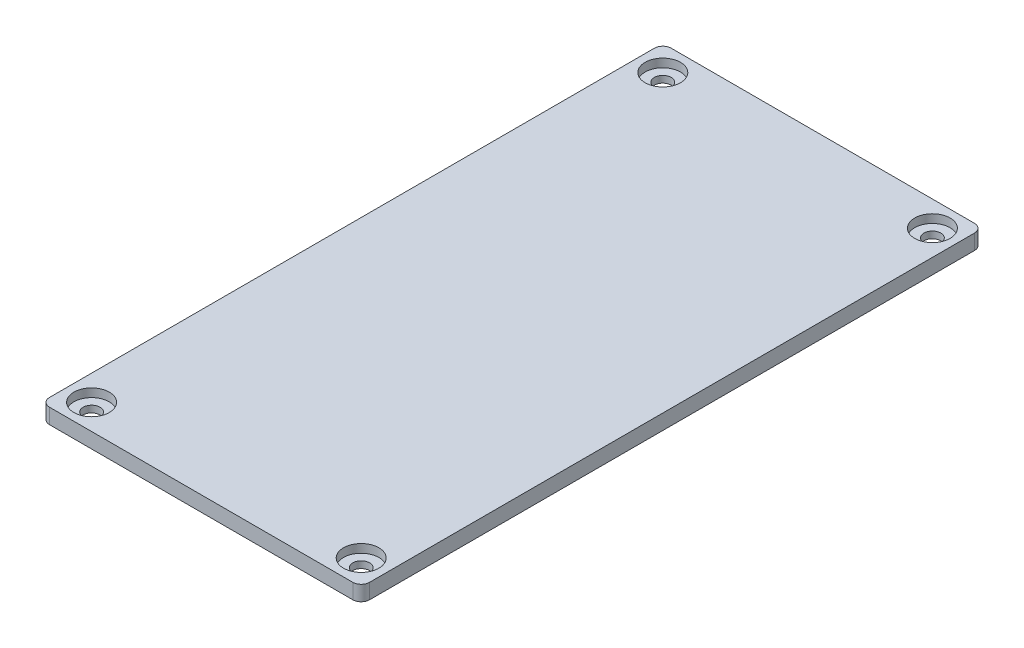
ISO-10303-21;
HEADER;
FILE_DESCRIPTION(('STEP AP214'),'2;1');
FILE_NAME('part.step','',(''),(''),'','','');
FILE_SCHEMA(('AUTOMOTIVE_DESIGN { 1 0 10303 214 1 1 1 1 }'));
ENDSEC;
DATA;
#1=APPLICATION_CONTEXT('core data for automotive mechanical design processes');
#2=APPLICATION_PROTOCOL_DEFINITION('international standard','automotive_design',2000,#1);
#3=PRODUCT_CONTEXT('',#1,'mechanical');
#4=PRODUCT('Part','Part','',(#3));
#5=PRODUCT_RELATED_PRODUCT_CATEGORY('part','',(#4));
#6=PRODUCT_DEFINITION_FORMATION('','',#4);
#7=PRODUCT_DEFINITION_CONTEXT('part definition',#1,'design');
#8=PRODUCT_DEFINITION('design','',#6,#7);
#9=PRODUCT_DEFINITION_SHAPE('','',#8);
#10=(LENGTH_UNIT() NAMED_UNIT(*) SI_UNIT(.MILLI.,.METRE.));
#11=(NAMED_UNIT(*) PLANE_ANGLE_UNIT() SI_UNIT($,.RADIAN.));
#12=(NAMED_UNIT(*) SI_UNIT($,.STERADIAN.) SOLID_ANGLE_UNIT());
#13=UNCERTAINTY_MEASURE_WITH_UNIT(LENGTH_MEASURE(1.E-05),#10,'distance_accuracy_value','');
#14=(GEOMETRIC_REPRESENTATION_CONTEXT(3) GLOBAL_UNCERTAINTY_ASSIGNED_CONTEXT((#13)) GLOBAL_UNIT_ASSIGNED_CONTEXT((#10,
#11,#12)) REPRESENTATION_CONTEXT('',''));
#15=CARTESIAN_POINT('',(0.,0.,0.));
#16=DIRECTION('',(0.,0.,1.));
#17=DIRECTION('',(1.,0.,0.));
#18=AXIS2_PLACEMENT_3D('',#15,#16,#17);
#19=CARTESIAN_POINT('',(16.,0.,33.9));
#20=DIRECTION('',(0.,1.,0.));
#21=DIRECTION('',(0.,0.,1.));
#22=AXIS2_PLACEMENT_3D('',#19,#20,#21);
#23=CYLINDRICAL_SURFACE('',#22,1.);
#24=CARTESIAN_POINT('',(16.,0.,33.9));
#25=DIRECTION('',(0.,-1.,0.));
#26=DIRECTION('',(0.,0.,-1.));
#27=AXIS2_PLACEMENT_3D('',#24,#25,#26);
#28=CIRCLE('',#27,1.);
#29=CARTESIAN_POINT('',(16.,0.,32.9));
#30=VERTEX_POINT('',#29);
#31=EDGE_CURVE('E147',#30,#30,#28,.T.);
#32=ORIENTED_EDGE('',*,*,#31,.T.);
#33=EDGE_LOOP('',(#32));
#34=FACE_BOUND('',#33,.T.);
#35=CARTESIAN_POINT('',(16.,0.8,33.9));
#36=DIRECTION('',(0.,1.,0.));
#37=DIRECTION('',(0.,0.,1.));
#38=AXIS2_PLACEMENT_3D('',#35,#36,#37);
#39=CIRCLE('',#38,1.);
#40=CARTESIAN_POINT('',(16.,0.8,34.9));
#41=VERTEX_POINT('',#40);
#42=EDGE_CURVE('E143',#41,#41,#39,.T.);
#43=ORIENTED_EDGE('',*,*,#42,.T.);
#44=EDGE_LOOP('',(#43));
#45=FACE_BOUND('',#44,.T.);
#46=ADVANCED_FACE('F33',(#34,#45),#23,.F.);
#47=CARTESIAN_POINT('',(-16.,0.,33.9));
#48=DIRECTION('',(0.,1.,0.));
#49=DIRECTION('',(0.,0.,1.));
#50=AXIS2_PLACEMENT_3D('',#47,#48,#49);
#51=CYLINDRICAL_SURFACE('',#50,1.);
#52=CARTESIAN_POINT('',(-16.,0.,33.9));
#53=DIRECTION('',(0.,-1.,0.));
#54=DIRECTION('',(0.,0.,-1.));
#55=AXIS2_PLACEMENT_3D('',#52,#53,#54);
#56=CIRCLE('',#55,1.);
#57=CARTESIAN_POINT('',(-16.,0.,32.9));
#58=VERTEX_POINT('',#57);
#59=EDGE_CURVE('E202',#58,#58,#56,.T.);
#60=ORIENTED_EDGE('',*,*,#59,.T.);
#61=EDGE_LOOP('',(#60));
#62=FACE_BOUND('',#61,.T.);
#63=CARTESIAN_POINT('',(-16.,0.8,33.9));
#64=DIRECTION('',(0.,1.,0.));
#65=DIRECTION('',(0.,0.,1.));
#66=AXIS2_PLACEMENT_3D('',#63,#64,#65);
#67=CIRCLE('',#66,1.);
#68=CARTESIAN_POINT('',(-16.,0.8,34.9));
#69=VERTEX_POINT('',#68);
#70=EDGE_CURVE('E140',#69,#69,#67,.T.);
#71=ORIENTED_EDGE('',*,*,#70,.T.);
#72=EDGE_LOOP('',(#71));
#73=FACE_BOUND('',#72,.T.);
#74=ADVANCED_FACE('F245',(#62,#73),#51,.F.);
#75=CARTESIAN_POINT('',(16.,0.,-33.9));
#76=DIRECTION('',(0.,1.,0.));
#77=DIRECTION('',(0.,0.,1.));
#78=AXIS2_PLACEMENT_3D('',#75,#76,#77);
#79=CYLINDRICAL_SURFACE('',#78,1.);
#80=CARTESIAN_POINT('',(16.,0.,-33.9));
#81=DIRECTION('',(0.,1.,0.));
#82=DIRECTION('',(0.,0.,1.));
#83=AXIS2_PLACEMENT_3D('',#80,#81,#82);
#84=CIRCLE('',#83,1.);
#85=CARTESIAN_POINT('',(16.,0.,-32.9));
#86=VERTEX_POINT('',#85);
#87=EDGE_CURVE('E139',#86,#86,#84,.T.);
#88=ORIENTED_EDGE('',*,*,#87,.F.);
#89=EDGE_LOOP('',(#88));
#90=FACE_BOUND('',#89,.T.);
#91=CARTESIAN_POINT('',(16.,0.8,-33.9));
#92=DIRECTION('',(0.,1.,0.));
#93=DIRECTION('',(0.,0.,1.));
#94=AXIS2_PLACEMENT_3D('',#91,#92,#93);
#95=CIRCLE('',#94,1.);
#96=CARTESIAN_POINT('',(16.,0.8,-32.9));
#97=VERTEX_POINT('',#96);
#98=EDGE_CURVE('E135',#97,#97,#95,.F.);
#99=ORIENTED_EDGE('',*,*,#98,.F.);
#100=EDGE_LOOP('',(#99));
#101=FACE_BOUND('',#100,.T.);
#102=ADVANCED_FACE('F251',(#90,#101),#79,.F.);
#103=CARTESIAN_POINT('',(-16.,0.,-33.9));
#104=DIRECTION('',(0.,1.,0.));
#105=DIRECTION('',(0.,0.,1.));
#106=AXIS2_PLACEMENT_3D('',#103,#104,#105);
#107=CYLINDRICAL_SURFACE('',#106,1.);
#108=CARTESIAN_POINT('',(-16.,0.,-33.9));
#109=DIRECTION('',(0.,1.,0.));
#110=DIRECTION('',(0.,0.,1.));
#111=AXIS2_PLACEMENT_3D('',#108,#109,#110);
#112=CIRCLE('',#111,1.);
#113=CARTESIAN_POINT('',(-16.,0.,-32.9));
#114=VERTEX_POINT('',#113);
#115=EDGE_CURVE('E192',#114,#114,#112,.T.);
#116=ORIENTED_EDGE('',*,*,#115,.F.);
#117=EDGE_LOOP('',(#116));
#118=FACE_BOUND('',#117,.T.);
#119=CARTESIAN_POINT('',(-16.,0.8,-33.9));
#120=DIRECTION('',(0.,1.,0.));
#121=DIRECTION('',(0.,0.,1.));
#122=AXIS2_PLACEMENT_3D('',#119,#120,#121);
#123=CIRCLE('',#122,1.);
#124=CARTESIAN_POINT('',(-16.,0.8,-32.9));
#125=VERTEX_POINT('',#124);
#126=EDGE_CURVE('E132',#125,#125,#123,.F.);
#127=ORIENTED_EDGE('',*,*,#126,.F.);
#128=EDGE_LOOP('',(#127));
#129=FACE_BOUND('',#128,.T.);
#130=ADVANCED_FACE('F271',(#118,#129),#107,.F.);
#131=CARTESIAN_POINT('',(19.,1.8,36.9));
#132=DIRECTION('',(-1.,0.,0.));
#133=DIRECTION('',(0.,0.,1.));
#134=AXIS2_PLACEMENT_3D('',#131,#132,#133);
#135=PLANE('',#134);
#136=DIRECTION('',(0.,0.,-1.));
#137=VECTOR('',#136,1.);
#138=CARTESIAN_POINT('',(19.,0.,36.9));
#139=LINE('',#138,#137);
#140=CARTESIAN_POINT('',(19.,0.,35.9));
#141=VERTEX_POINT('',#140);
#142=CARTESIAN_POINT('',(19.,0.,-35.9));
#143=VERTEX_POINT('',#142);
#144=EDGE_CURVE('E128',#141,#143,#139,.T.);
#145=ORIENTED_EDGE('',*,*,#144,.T.);
#146=DIRECTION('',(0.,-1.,0.));
#147=VECTOR('',#146,1.);
#148=CARTESIAN_POINT('',(19.,1.8,-35.9));
#149=LINE('',#148,#147);
#150=CARTESIAN_POINT('',(19.,1.8,-35.9));
#151=VERTEX_POINT('',#150);
#152=EDGE_CURVE('E167',#143,#151,#149,.F.);
#153=ORIENTED_EDGE('',*,*,#152,.T.);
#154=DIRECTION('',(0.,0.,-1.));
#155=VECTOR('',#154,1.);
#156=CARTESIAN_POINT('',(19.,1.8,36.9));
#157=LINE('',#156,#155);
#158=CARTESIAN_POINT('',(19.,1.8,35.9));
#159=VERTEX_POINT('',#158);
#160=EDGE_CURVE('E126',#159,#151,#157,.T.);
#161=ORIENTED_EDGE('',*,*,#160,.F.);
#162=DIRECTION('',(0.,-1.,0.));
#163=VECTOR('',#162,1.);
#164=CARTESIAN_POINT('',(19.,1.8,35.9));
#165=LINE('',#164,#163);
#166=EDGE_CURVE('E164',#159,#141,#165,.T.);
#167=ORIENTED_EDGE('',*,*,#166,.T.);
#168=EDGE_LOOP('',(#145,#153,#161,#167));
#169=FACE_BOUND('',#168,.T.);
#170=ADVANCED_FACE('F180',(#169),#135,.F.);
#171=CARTESIAN_POINT('',(-19.,1.8,-36.9));
#172=DIRECTION('',(0.,0.,1.));
#173=DIRECTION('',(1.,0.,0.));
#174=AXIS2_PLACEMENT_3D('',#171,#172,#173);
#175=PLANE('',#174);
#176=DIRECTION('',(-1.,0.,0.));
#177=VECTOR('',#176,1.);
#178=CARTESIAN_POINT('',(-19.,0.,-36.9));
#179=LINE('',#178,#177);
#180=CARTESIAN_POINT('',(18.,0.,-36.9));
#181=VERTEX_POINT('',#180);
#182=CARTESIAN_POINT('',(-18.,0.,-36.9));
#183=VERTEX_POINT('',#182);
#184=EDGE_CURVE('E124',#181,#183,#179,.T.);
#185=ORIENTED_EDGE('',*,*,#184,.T.);
#186=DIRECTION('',(0.,-1.,0.));
#187=VECTOR('',#186,1.);
#188=CARTESIAN_POINT('',(-18.,1.8,-36.9));
#189=LINE('',#188,#187);
#190=CARTESIAN_POINT('',(-18.,1.8,-36.9));
#191=VERTEX_POINT('',#190);
#192=EDGE_CURVE('E103',#183,#191,#189,.F.);
#193=ORIENTED_EDGE('',*,*,#192,.T.);
#194=DIRECTION('',(-1.,0.,0.));
#195=VECTOR('',#194,1.);
#196=CARTESIAN_POINT('',(-19.,1.8,-36.9));
#197=LINE('',#196,#195);
#198=CARTESIAN_POINT('',(18.,1.8,-36.9));
#199=VERTEX_POINT('',#198);
#200=EDGE_CURVE('E184',#199,#191,#197,.T.);
#201=ORIENTED_EDGE('',*,*,#200,.F.);
#202=DIRECTION('',(0.,-1.,0.));
#203=VECTOR('',#202,1.);
#204=CARTESIAN_POINT('',(18.,1.8,-36.9));
#205=LINE('',#204,#203);
#206=EDGE_CURVE('E108',#199,#181,#205,.T.);
#207=ORIENTED_EDGE('',*,*,#206,.T.);
#208=EDGE_LOOP('',(#185,#193,#201,#207));
#209=FACE_BOUND('',#208,.T.);
#210=ADVANCED_FACE('F289',(#209),#175,.F.);
#211=CARTESIAN_POINT('',(-19.,1.8,36.9));
#212=DIRECTION('',(1.,0.,0.));
#213=DIRECTION('',(0.,0.,-1.));
#214=AXIS2_PLACEMENT_3D('',#211,#212,#213);
#215=PLANE('',#214);
#216=DIRECTION('',(0.,0.,1.));
#217=VECTOR('',#216,1.);
#218=CARTESIAN_POINT('',(-19.,1.8,36.9));
#219=LINE('',#218,#217);
#220=CARTESIAN_POINT('',(-19.,1.8,-35.9));
#221=VERTEX_POINT('',#220);
#222=CARTESIAN_POINT('',(-19.,1.8,35.9));
#223=VERTEX_POINT('',#222);
#224=EDGE_CURVE('E117',#221,#223,#219,.T.);
#225=ORIENTED_EDGE('',*,*,#224,.F.);
#226=DIRECTION('',(0.,-1.,0.));
#227=VECTOR('',#226,1.);
#228=CARTESIAN_POINT('',(-19.,1.8,-35.9));
#229=LINE('',#228,#227);
#230=CARTESIAN_POINT('',(-19.,0.,-35.9));
#231=VERTEX_POINT('',#230);
#232=EDGE_CURVE('E102',#221,#231,#229,.T.);
#233=ORIENTED_EDGE('',*,*,#232,.T.);
#234=DIRECTION('',(0.,0.,1.));
#235=VECTOR('',#234,1.);
#236=CARTESIAN_POINT('',(-19.,0.,36.9));
#237=LINE('',#236,#235);
#238=CARTESIAN_POINT('',(-19.,0.,35.9));
#239=VERTEX_POINT('',#238);
#240=EDGE_CURVE('E115',#231,#239,#237,.T.);
#241=ORIENTED_EDGE('',*,*,#240,.T.);
#242=DIRECTION('',(0.,-1.,0.));
#243=VECTOR('',#242,1.);
#244=CARTESIAN_POINT('',(-19.,1.8,35.9));
#245=LINE('',#244,#243);
#246=EDGE_CURVE('E119',#239,#223,#245,.F.);
#247=ORIENTED_EDGE('',*,*,#246,.T.);
#248=EDGE_LOOP('',(#225,#233,#241,#247));
#249=FACE_BOUND('',#248,.T.);
#250=ADVANCED_FACE('F114',(#249),#215,.F.);
#251=CARTESIAN_POINT('',(-19.,1.8,36.9));
#252=DIRECTION('',(0.,0.,-1.));
#253=DIRECTION('',(-1.,0.,0.));
#254=AXIS2_PLACEMENT_3D('',#251,#252,#253);
#255=PLANE('',#254);
#256=DIRECTION('',(1.,0.,0.));
#257=VECTOR('',#256,1.);
#258=CARTESIAN_POINT('',(-19.,0.,36.9));
#259=LINE('',#258,#257);
#260=CARTESIAN_POINT('',(-18.,0.,36.9));
#261=VERTEX_POINT('',#260);
#262=CARTESIAN_POINT('',(18.,0.,36.9));
#263=VERTEX_POINT('',#262);
#264=EDGE_CURVE('E123',#261,#263,#259,.T.);
#265=ORIENTED_EDGE('',*,*,#264,.T.);
#266=DIRECTION('',(0.,-1.,0.));
#267=VECTOR('',#266,1.);
#268=CARTESIAN_POINT('',(18.,1.8,36.9));
#269=LINE('',#268,#267);
#270=CARTESIAN_POINT('',(18.,1.8,36.9));
#271=VERTEX_POINT('',#270);
#272=EDGE_CURVE('E11',#263,#271,#269,.F.);
#273=ORIENTED_EDGE('',*,*,#272,.T.);
#274=DIRECTION('',(1.,0.,0.));
#275=VECTOR('',#274,1.);
#276=CARTESIAN_POINT('',(-19.,1.8,36.9));
#277=LINE('',#276,#275);
#278=CARTESIAN_POINT('',(-18.,1.8,36.9));
#279=VERTEX_POINT('',#278);
#280=EDGE_CURVE('E148',#279,#271,#277,.T.);
#281=ORIENTED_EDGE('',*,*,#280,.F.);
#282=DIRECTION('',(0.,-1.,0.));
#283=VECTOR('',#282,1.);
#284=CARTESIAN_POINT('',(-18.,1.8,36.9));
#285=LINE('',#284,#283);
#286=EDGE_CURVE('E41',#279,#261,#285,.T.);
#287=ORIENTED_EDGE('',*,*,#286,.T.);
#288=EDGE_LOOP('',(#265,#273,#281,#287));
#289=FACE_BOUND('',#288,.T.);
#290=ADVANCED_FACE('F170',(#289),#255,.F.);
#291=CARTESIAN_POINT('',(0.,1.8,0.));
#292=DIRECTION('',(0.,-1.,0.));
#293=DIRECTION('',(0.,0.,-1.));
#294=AXIS2_PLACEMENT_3D('',#291,#292,#293);
#295=PLANE('',#294);
#296=CARTESIAN_POINT('',(-16.,1.8,33.9));
#297=DIRECTION('',(0.,-1.,0.));
#298=DIRECTION('',(0.,0.,-1.));
#299=AXIS2_PLACEMENT_3D('',#296,#297,#298);
#300=CIRCLE('',#299,2.1);
#301=CARTESIAN_POINT('',(-16.,1.8,31.8));
#302=VERTEX_POINT('',#301);
#303=EDGE_CURVE('E220',#302,#302,#300,.T.);
#304=ORIENTED_EDGE('',*,*,#303,.T.);
#305=EDGE_LOOP('',(#304));
#306=FACE_BOUND('',#305,.T.);
#307=CARTESIAN_POINT('',(16.,1.8,33.9));
#308=DIRECTION('',(0.,-1.,0.));
#309=DIRECTION('',(0.,0.,-1.));
#310=AXIS2_PLACEMENT_3D('',#307,#308,#309);
#311=CIRCLE('',#310,2.1);
#312=CARTESIAN_POINT('',(16.,1.8,31.8));
#313=VERTEX_POINT('',#312);
#314=EDGE_CURVE('E214',#313,#313,#311,.T.);
#315=ORIENTED_EDGE('',*,*,#314,.T.);
#316=EDGE_LOOP('',(#315));
#317=FACE_BOUND('',#316,.T.);
#318=CARTESIAN_POINT('',(-16.,1.8,-33.9));
#319=DIRECTION('',(0.,1.,0.));
#320=DIRECTION('',(0.,0.,1.));
#321=AXIS2_PLACEMENT_3D('',#318,#319,#320);
#322=CIRCLE('',#321,2.1);
#323=CARTESIAN_POINT('',(-16.,1.8,-31.8));
#324=VERTEX_POINT('',#323);
#325=EDGE_CURVE('E205',#324,#324,#322,.T.);
#326=ORIENTED_EDGE('',*,*,#325,.F.);
#327=EDGE_LOOP('',(#326));
#328=FACE_BOUND('',#327,.T.);
#329=CARTESIAN_POINT('',(16.,1.8,-33.9));
#330=DIRECTION('',(0.,1.,0.));
#331=DIRECTION('',(0.,0.,1.));
#332=AXIS2_PLACEMENT_3D('',#329,#330,#331);
#333=CIRCLE('',#332,2.1);
#334=CARTESIAN_POINT('',(16.,1.8,-31.8));
#335=VERTEX_POINT('',#334);
#336=EDGE_CURVE('E198',#335,#335,#333,.T.);
#337=ORIENTED_EDGE('',*,*,#336,.F.);
#338=EDGE_LOOP('',(#337));
#339=FACE_BOUND('',#338,.T.);
#340=ORIENTED_EDGE('',*,*,#200,.T.);
#341=CARTESIAN_POINT('',(-18.,1.8,-35.9));
#342=DIRECTION('',(0.,-1.,0.));
#343=DIRECTION('',(0.,0.,-1.));
#344=AXIS2_PLACEMENT_3D('',#341,#342,#343);
#345=CIRCLE('',#344,1.);
#346=EDGE_CURVE('E162',#191,#221,#345,.F.);
#347=ORIENTED_EDGE('',*,*,#346,.T.);
#348=ORIENTED_EDGE('',*,*,#224,.T.);
#349=CARTESIAN_POINT('',(-18.,1.8,35.9));
#350=DIRECTION('',(0.,-1.,0.));
#351=DIRECTION('',(0.,0.,-1.));
#352=AXIS2_PLACEMENT_3D('',#349,#350,#351);
#353=CIRCLE('',#352,1.);
#354=EDGE_CURVE('E53',#223,#279,#353,.F.);
#355=ORIENTED_EDGE('',*,*,#354,.T.);
#356=ORIENTED_EDGE('',*,*,#280,.T.);
#357=CARTESIAN_POINT('',(18.,1.8,35.9));
#358=DIRECTION('',(0.,-1.,0.));
#359=DIRECTION('',(0.,0.,-1.));
#360=AXIS2_PLACEMENT_3D('',#357,#358,#359);
#361=CIRCLE('',#360,1.);
#362=EDGE_CURVE('E158',#271,#159,#361,.F.);
#363=ORIENTED_EDGE('',*,*,#362,.T.);
#364=ORIENTED_EDGE('',*,*,#160,.T.);
#365=CARTESIAN_POINT('',(18.,1.8,-35.9));
#366=DIRECTION('',(0.,-1.,0.));
#367=DIRECTION('',(0.,0.,-1.));
#368=AXIS2_PLACEMENT_3D('',#365,#366,#367);
#369=CIRCLE('',#368,1.);
#370=EDGE_CURVE('E160',#151,#199,#369,.F.);
#371=ORIENTED_EDGE('',*,*,#370,.T.);
#372=EDGE_LOOP('',(#340,#347,#348,#355,#356,#363,#364,#371));
#373=FACE_BOUND('',#372,.T.);
#374=ADVANCED_FACE('F278',(#306,#317,#328,#339,#373),#295,.F.);
#375=CARTESIAN_POINT('',(0.,0.,0.));
#376=DIRECTION('',(0.,-1.,0.));
#377=DIRECTION('',(0.,0.,-1.));
#378=AXIS2_PLACEMENT_3D('',#375,#376,#377);
#379=PLANE('',#378);
#380=ORIENTED_EDGE('',*,*,#59,.F.);
#381=EDGE_LOOP('',(#380));
#382=FACE_BOUND('',#381,.T.);
#383=ORIENTED_EDGE('',*,*,#31,.F.);
#384=EDGE_LOOP('',(#383));
#385=FACE_BOUND('',#384,.T.);
#386=ORIENTED_EDGE('',*,*,#115,.T.);
#387=EDGE_LOOP('',(#386));
#388=FACE_BOUND('',#387,.T.);
#389=ORIENTED_EDGE('',*,*,#87,.T.);
#390=EDGE_LOOP('',(#389));
#391=FACE_BOUND('',#390,.T.);
#392=ORIENTED_EDGE('',*,*,#240,.F.);
#393=CARTESIAN_POINT('',(-18.,0.,-35.9));
#394=DIRECTION('',(0.,-1.,0.));
#395=DIRECTION('',(0.,0.,-1.));
#396=AXIS2_PLACEMENT_3D('',#393,#394,#395);
#397=CIRCLE('',#396,1.);
#398=EDGE_CURVE('E98',#231,#183,#397,.T.);
#399=ORIENTED_EDGE('',*,*,#398,.T.);
#400=ORIENTED_EDGE('',*,*,#184,.F.);
#401=CARTESIAN_POINT('',(18.,0.,-35.9));
#402=DIRECTION('',(0.,-1.,0.));
#403=DIRECTION('',(0.,0.,-1.));
#404=AXIS2_PLACEMENT_3D('',#401,#402,#403);
#405=CIRCLE('',#404,1.);
#406=EDGE_CURVE('E109',#181,#143,#405,.T.);
#407=ORIENTED_EDGE('',*,*,#406,.T.);
#408=ORIENTED_EDGE('',*,*,#144,.F.);
#409=CARTESIAN_POINT('',(18.,0.,35.9));
#410=DIRECTION('',(0.,-1.,0.));
#411=DIRECTION('',(0.,0.,-1.));
#412=AXIS2_PLACEMENT_3D('',#409,#410,#411);
#413=CIRCLE('',#412,1.);
#414=EDGE_CURVE('E151',#141,#263,#413,.T.);
#415=ORIENTED_EDGE('',*,*,#414,.T.);
#416=ORIENTED_EDGE('',*,*,#264,.F.);
#417=CARTESIAN_POINT('',(-18.,0.,35.9));
#418=DIRECTION('',(0.,-1.,0.));
#419=DIRECTION('',(0.,0.,-1.));
#420=AXIS2_PLACEMENT_3D('',#417,#418,#419);
#421=CIRCLE('',#420,1.);
#422=EDGE_CURVE('E118',#261,#239,#421,.T.);
#423=ORIENTED_EDGE('',*,*,#422,.T.);
#424=EDGE_LOOP('',(#392,#399,#400,#407,#408,#415,#416,#423));
#425=FACE_BOUND('',#424,.T.);
#426=ADVANCED_FACE('F121',(#382,#385,#388,#391,#425),#379,.T.);
#427=CARTESIAN_POINT('',(-16.,0.8,-33.9));
#428=DIRECTION('',(0.,1.,0.));
#429=DIRECTION('',(0.,0.,1.));
#430=AXIS2_PLACEMENT_3D('',#427,#428,#429);
#431=PLANE('',#430);
#432=CARTESIAN_POINT('',(-16.,0.8,-33.9));
#433=DIRECTION('',(0.,1.,0.));
#434=DIRECTION('',(0.,0.,1.));
#435=AXIS2_PLACEMENT_3D('',#432,#433,#434);
#436=CIRCLE('',#435,2.1);
#437=CARTESIAN_POINT('',(-16.,0.8,-31.8));
#438=VERTEX_POINT('',#437);
#439=EDGE_CURVE('E136',#438,#438,#436,.T.);
#440=ORIENTED_EDGE('',*,*,#439,.T.);
#441=EDGE_LOOP('',(#440));
#442=FACE_BOUND('',#441,.T.);
#443=ORIENTED_EDGE('',*,*,#126,.T.);
#444=EDGE_LOOP('',(#443));
#445=FACE_BOUND('',#444,.T.);
#446=ADVANCED_FACE('F256',(#442,#445),#431,.T.);
#447=CARTESIAN_POINT('',(-16.,0.8,-33.9));
#448=DIRECTION('',(0.,1.,0.));
#449=DIRECTION('',(0.,0.,1.));
#450=AXIS2_PLACEMENT_3D('',#447,#448,#449);
#451=CYLINDRICAL_SURFACE('',#450,2.1);
#452=ORIENTED_EDGE('',*,*,#439,.F.);
#453=EDGE_LOOP('',(#452));
#454=FACE_BOUND('',#453,.T.);
#455=ORIENTED_EDGE('',*,*,#325,.T.);
#456=EDGE_LOOP('',(#455));
#457=FACE_BOUND('',#456,.T.);
#458=ADVANCED_FACE('F259',(#454,#457),#451,.F.);
#459=CARTESIAN_POINT('',(16.,0.8,-33.9));
#460=DIRECTION('',(0.,1.,0.));
#461=DIRECTION('',(0.,0.,1.));
#462=AXIS2_PLACEMENT_3D('',#459,#460,#461);
#463=PLANE('',#462);
#464=CARTESIAN_POINT('',(16.,0.8,-33.9));
#465=DIRECTION('',(0.,1.,0.));
#466=DIRECTION('',(0.,0.,1.));
#467=AXIS2_PLACEMENT_3D('',#464,#465,#466);
#468=CIRCLE('',#467,2.1);
#469=CARTESIAN_POINT('',(16.,0.8,-31.8));
#470=VERTEX_POINT('',#469);
#471=EDGE_CURVE('E201',#470,#470,#468,.T.);
#472=ORIENTED_EDGE('',*,*,#471,.T.);
#473=EDGE_LOOP('',(#472));
#474=FACE_BOUND('',#473,.T.);
#475=ORIENTED_EDGE('',*,*,#98,.T.);
#476=EDGE_LOOP('',(#475));
#477=FACE_BOUND('',#476,.T.);
#478=ADVANCED_FACE('F263',(#474,#477),#463,.T.);
#479=CARTESIAN_POINT('',(16.,0.8,-33.9));
#480=DIRECTION('',(0.,1.,0.));
#481=DIRECTION('',(0.,0.,1.));
#482=AXIS2_PLACEMENT_3D('',#479,#480,#481);
#483=CYLINDRICAL_SURFACE('',#482,2.1);
#484=ORIENTED_EDGE('',*,*,#471,.F.);
#485=EDGE_LOOP('',(#484));
#486=FACE_BOUND('',#485,.T.);
#487=ORIENTED_EDGE('',*,*,#336,.T.);
#488=EDGE_LOOP('',(#487));
#489=FACE_BOUND('',#488,.T.);
#490=ADVANCED_FACE('F241',(#486,#489),#483,.F.);
#491=CARTESIAN_POINT('',(-16.,0.8,33.9));
#492=DIRECTION('',(0.,1.,0.));
#493=DIRECTION('',(0.,0.,1.));
#494=AXIS2_PLACEMENT_3D('',#491,#492,#493);
#495=CYLINDRICAL_SURFACE('',#494,2.1);
#496=CARTESIAN_POINT('',(-16.,0.8,33.9));
#497=DIRECTION('',(0.,-1.,0.));
#498=DIRECTION('',(0.,0.,-1.));
#499=AXIS2_PLACEMENT_3D('',#496,#497,#498);
#500=CIRCLE('',#499,2.1);
#501=CARTESIAN_POINT('',(-16.,0.8,31.8));
#502=VERTEX_POINT('',#501);
#503=EDGE_CURVE('E144',#502,#502,#500,.T.);
#504=ORIENTED_EDGE('',*,*,#503,.T.);
#505=EDGE_LOOP('',(#504));
#506=FACE_BOUND('',#505,.T.);
#507=ORIENTED_EDGE('',*,*,#303,.F.);
#508=EDGE_LOOP('',(#507));
#509=FACE_BOUND('',#508,.T.);
#510=ADVANCED_FACE('F226',(#506,#509),#495,.F.);
#511=CARTESIAN_POINT('',(-16.,0.8,33.9));
#512=DIRECTION('',(0.,1.,0.));
#513=DIRECTION('',(0.,0.,-1.));
#514=AXIS2_PLACEMENT_3D('',#511,#512,#513);
#515=PLANE('',#514);
#516=ORIENTED_EDGE('',*,*,#70,.F.);
#517=EDGE_LOOP('',(#516));
#518=FACE_BOUND('',#517,.T.);
#519=ORIENTED_EDGE('',*,*,#503,.F.);
#520=EDGE_LOOP('',(#519));
#521=FACE_BOUND('',#520,.T.);
#522=ADVANCED_FACE('F229',(#518,#521),#515,.T.);
#523=CARTESIAN_POINT('',(16.,0.8,33.9));
#524=DIRECTION('',(0.,1.,0.));
#525=DIRECTION('',(0.,0.,1.));
#526=AXIS2_PLACEMENT_3D('',#523,#524,#525);
#527=CYLINDRICAL_SURFACE('',#526,2.1);
#528=CARTESIAN_POINT('',(16.,0.8,33.9));
#529=DIRECTION('',(0.,-1.,0.));
#530=DIRECTION('',(0.,0.,-1.));
#531=AXIS2_PLACEMENT_3D('',#528,#529,#530);
#532=CIRCLE('',#531,2.1);
#533=CARTESIAN_POINT('',(16.,0.8,31.8));
#534=VERTEX_POINT('',#533);
#535=EDGE_CURVE('E217',#534,#534,#532,.T.);
#536=ORIENTED_EDGE('',*,*,#535,.T.);
#537=EDGE_LOOP('',(#536));
#538=FACE_BOUND('',#537,.T.);
#539=ORIENTED_EDGE('',*,*,#314,.F.);
#540=EDGE_LOOP('',(#539));
#541=FACE_BOUND('',#540,.T.);
#542=ADVANCED_FACE('F231',(#538,#541),#527,.F.);
#543=CARTESIAN_POINT('',(16.,0.8,33.9));
#544=DIRECTION('',(0.,1.,0.));
#545=DIRECTION('',(0.,0.,-1.));
#546=AXIS2_PLACEMENT_3D('',#543,#544,#545);
#547=PLANE('',#546);
#548=ORIENTED_EDGE('',*,*,#42,.F.);
#549=EDGE_LOOP('',(#548));
#550=FACE_BOUND('',#549,.T.);
#551=ORIENTED_EDGE('',*,*,#535,.F.);
#552=EDGE_LOOP('',(#551));
#553=FACE_BOUND('',#552,.T.);
#554=ADVANCED_FACE('F238',(#550,#553),#547,.T.);
#555=CARTESIAN_POINT('',(-18.,1.8,-35.9));
#556=DIRECTION('',(0.,-1.,0.));
#557=DIRECTION('',(0.,0.,-1.));
#558=AXIS2_PLACEMENT_3D('',#555,#556,#557);
#559=CYLINDRICAL_SURFACE('',#558,1.);
#560=ORIENTED_EDGE('',*,*,#346,.F.);
#561=ORIENTED_EDGE('',*,*,#192,.F.);
#562=ORIENTED_EDGE('',*,*,#398,.F.);
#563=ORIENTED_EDGE('',*,*,#232,.F.);
#564=EDGE_LOOP('',(#560,#561,#562,#563));
#565=FACE_BOUND('',#564,.T.);
#566=ADVANCED_FACE('F101',(#565),#559,.T.);
#567=CARTESIAN_POINT('',(18.,1.8,-35.9));
#568=DIRECTION('',(0.,-1.,0.));
#569=DIRECTION('',(0.,0.,-1.));
#570=AXIS2_PLACEMENT_3D('',#567,#568,#569);
#571=CYLINDRICAL_SURFACE('',#570,1.);
#572=ORIENTED_EDGE('',*,*,#370,.F.);
#573=ORIENTED_EDGE('',*,*,#152,.F.);
#574=ORIENTED_EDGE('',*,*,#406,.F.);
#575=ORIENTED_EDGE('',*,*,#206,.F.);
#576=EDGE_LOOP('',(#572,#573,#574,#575));
#577=FACE_BOUND('',#576,.T.);
#578=ADVANCED_FACE('F297',(#577),#571,.T.);
#579=CARTESIAN_POINT('',(18.,1.8,35.9));
#580=DIRECTION('',(0.,-1.,0.));
#581=DIRECTION('',(0.,0.,-1.));
#582=AXIS2_PLACEMENT_3D('',#579,#580,#581);
#583=CYLINDRICAL_SURFACE('',#582,1.);
#584=ORIENTED_EDGE('',*,*,#362,.F.);
#585=ORIENTED_EDGE('',*,*,#272,.F.);
#586=ORIENTED_EDGE('',*,*,#414,.F.);
#587=ORIENTED_EDGE('',*,*,#166,.F.);
#588=EDGE_LOOP('',(#584,#585,#586,#587));
#589=FACE_BOUND('',#588,.T.);
#590=ADVANCED_FACE('F177',(#589),#583,.T.);
#591=CARTESIAN_POINT('',(-18.,1.8,35.9));
#592=DIRECTION('',(0.,-1.,0.));
#593=DIRECTION('',(0.,0.,-1.));
#594=AXIS2_PLACEMENT_3D('',#591,#592,#593);
#595=CYLINDRICAL_SURFACE('',#594,1.);
#596=ORIENTED_EDGE('',*,*,#354,.F.);
#597=ORIENTED_EDGE('',*,*,#246,.F.);
#598=ORIENTED_EDGE('',*,*,#422,.F.);
#599=ORIENTED_EDGE('',*,*,#286,.F.);
#600=EDGE_LOOP('',(#596,#597,#598,#599));
#601=FACE_BOUND('',#600,.T.);
#602=ADVANCED_FACE('F35',(#601),#595,.T.);
#603=CLOSED_SHELL('',(#46,#74,#102,#130,#170,#210,#250,#290,#374,#426,#446,#458,#478,#490,#510,
#522,#542,#554,#566,#578,#590,#602));
#604=MANIFOLD_SOLID_BREP('B2',#603);
#605=ADVANCED_BREP_SHAPE_REPRESENTATION('',(#18,#604),#14);
#606=SHAPE_DEFINITION_REPRESENTATION(#9,#605);
ENDSEC;
END-ISO-10303-21;
